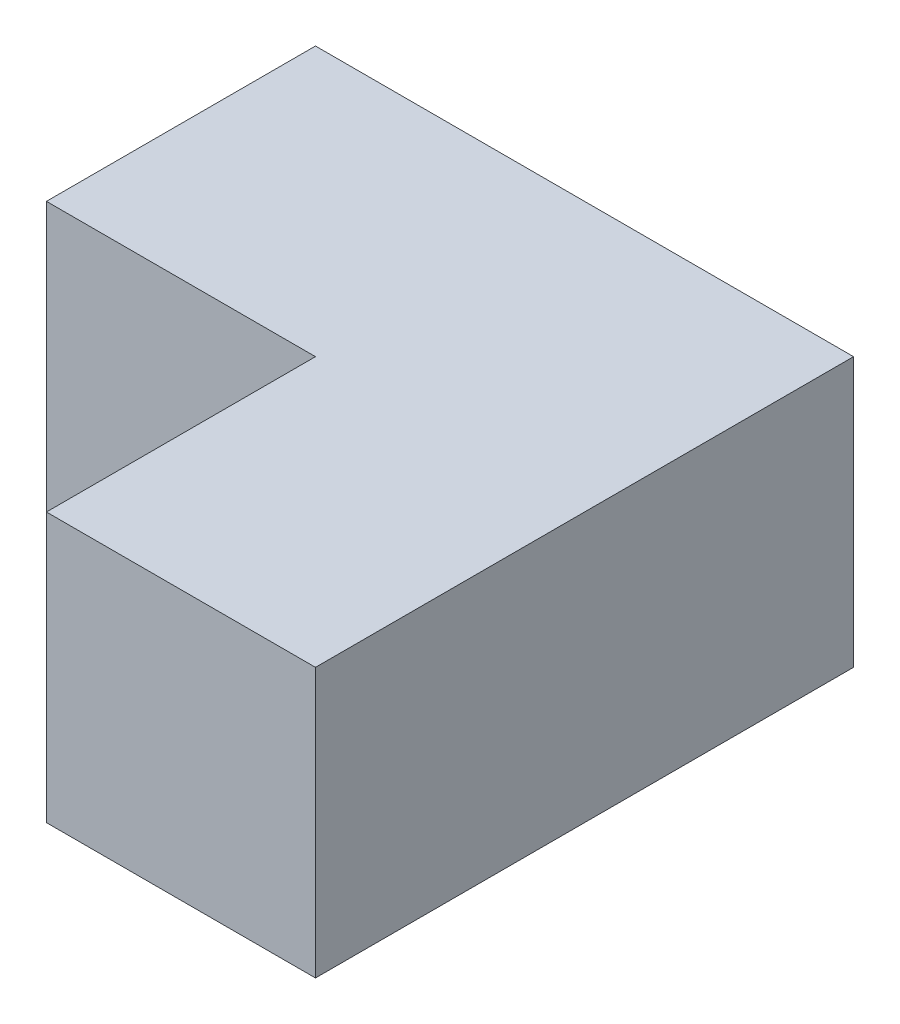
ISO-10303-21;
HEADER;
FILE_DESCRIPTION(('STEP AP214'),'2;1');
FILE_NAME('part.step','',(''),(''),'','','');
FILE_SCHEMA(('AUTOMOTIVE_DESIGN { 1 0 10303 214 1 1 1 1 }'));
ENDSEC;
DATA;
#1=APPLICATION_CONTEXT('core data for automotive mechanical design processes');
#2=APPLICATION_PROTOCOL_DEFINITION('international standard','automotive_design',2000,#1);
#3=PRODUCT_CONTEXT('',#1,'mechanical');
#4=PRODUCT('Part','Part','',(#3));
#5=PRODUCT_RELATED_PRODUCT_CATEGORY('part','',(#4));
#6=PRODUCT_DEFINITION_FORMATION('','',#4);
#7=PRODUCT_DEFINITION_CONTEXT('part definition',#1,'design');
#8=PRODUCT_DEFINITION('design','',#6,#7);
#9=PRODUCT_DEFINITION_SHAPE('','',#8);
#10=(LENGTH_UNIT() NAMED_UNIT(*) SI_UNIT(.MILLI.,.METRE.));
#11=(NAMED_UNIT(*) PLANE_ANGLE_UNIT() SI_UNIT($,.RADIAN.));
#12=(NAMED_UNIT(*) SI_UNIT($,.STERADIAN.) SOLID_ANGLE_UNIT());
#13=UNCERTAINTY_MEASURE_WITH_UNIT(LENGTH_MEASURE(1.E-05),#10,'distance_accuracy_value','');
#14=(GEOMETRIC_REPRESENTATION_CONTEXT(3) GLOBAL_UNCERTAINTY_ASSIGNED_CONTEXT((#13)) GLOBAL_UNIT_ASSIGNED_CONTEXT((#10,
#11,#12)) REPRESENTATION_CONTEXT('',''));
#15=CARTESIAN_POINT('',(0.,0.,0.));
#16=DIRECTION('',(0.,0.,1.));
#17=DIRECTION('',(1.,0.,0.));
#18=AXIS2_PLACEMENT_3D('',#15,#16,#17);
#19=CARTESIAN_POINT('',(25.4,25.4,25.4));
#20=DIRECTION('',(-1.,0.,0.));
#21=DIRECTION('',(0.,0.,1.));
#22=AXIS2_PLACEMENT_3D('',#19,#20,#21);
#23=PLANE('',#22);
#24=DIRECTION('',(0.,0.,-1.));
#25=VECTOR('',#24,1.);
#26=CARTESIAN_POINT('',(25.4,0.,25.4));
#27=LINE('',#26,#25);
#28=CARTESIAN_POINT('',(25.4,0.,25.4));
#29=VERTEX_POINT('',#28);
#30=CARTESIAN_POINT('',(25.4,0.,-25.4));
#31=VERTEX_POINT('',#30);
#32=EDGE_CURVE('E107',#29,#31,#27,.T.);
#33=ORIENTED_EDGE('',*,*,#32,.T.);
#34=DIRECTION('',(0.,-1.,0.));
#35=VECTOR('',#34,1.);
#36=CARTESIAN_POINT('',(25.4,25.4,-25.4));
#37=LINE('',#36,#35);
#38=CARTESIAN_POINT('',(25.4,25.4,-25.4));
#39=VERTEX_POINT('',#38);
#40=EDGE_CURVE('E11',#39,#31,#37,.T.);
#41=ORIENTED_EDGE('',*,*,#40,.F.);
#42=DIRECTION('',(0.,0.,-1.));
#43=VECTOR('',#42,1.);
#44=CARTESIAN_POINT('',(25.4,25.4,25.4));
#45=LINE('',#44,#43);
#46=CARTESIAN_POINT('',(25.4,25.4,25.4));
#47=VERTEX_POINT('',#46);
#48=EDGE_CURVE('E108',#47,#39,#45,.T.);
#49=ORIENTED_EDGE('',*,*,#48,.F.);
#50=DIRECTION('',(0.,-1.,0.));
#51=VECTOR('',#50,1.);
#52=CARTESIAN_POINT('',(25.4,25.4,25.4));
#53=LINE('',#52,#51);
#54=EDGE_CURVE('E117',#47,#29,#53,.T.);
#55=ORIENTED_EDGE('',*,*,#54,.T.);
#56=EDGE_LOOP('',(#33,#41,#49,#55));
#57=FACE_BOUND('',#56,.T.);
#58=ADVANCED_FACE('F33',(#57),#23,.F.);
#59=CARTESIAN_POINT('',(-25.4,25.4,-25.4));
#60=DIRECTION('',(0.,0.,1.));
#61=DIRECTION('',(1.,0.,0.));
#62=AXIS2_PLACEMENT_3D('',#59,#60,#61);
#63=PLANE('',#62);
#64=DIRECTION('',(-1.,0.,0.));
#65=VECTOR('',#64,1.);
#66=CARTESIAN_POINT('',(-25.4,0.,-25.4));
#67=LINE('',#66,#65);
#68=CARTESIAN_POINT('',(-25.4,0.,-25.4));
#69=VERTEX_POINT('',#68);
#70=EDGE_CURVE('E113',#31,#69,#67,.T.);
#71=ORIENTED_EDGE('',*,*,#70,.T.);
#72=DIRECTION('',(0.,-1.,0.));
#73=VECTOR('',#72,1.);
#74=CARTESIAN_POINT('',(-25.4,25.4,-25.4));
#75=LINE('',#74,#73);
#76=CARTESIAN_POINT('',(-25.4,25.4,-25.4));
#77=VERTEX_POINT('',#76);
#78=EDGE_CURVE('E40',#77,#69,#75,.T.);
#79=ORIENTED_EDGE('',*,*,#78,.F.);
#80=DIRECTION('',(-1.,0.,0.));
#81=VECTOR('',#80,1.);
#82=CARTESIAN_POINT('',(-25.4,25.4,-25.4));
#83=LINE('',#82,#81);
#84=EDGE_CURVE('E79',#39,#77,#83,.T.);
#85=ORIENTED_EDGE('',*,*,#84,.F.);
#86=ORIENTED_EDGE('',*,*,#40,.T.);
#87=EDGE_LOOP('',(#71,#79,#85,#86));
#88=FACE_BOUND('',#87,.T.);
#89=ADVANCED_FACE('F137',(#88),#63,.F.);
#90=CARTESIAN_POINT('',(-25.4,25.4,25.4));
#91=DIRECTION('',(1.,0.,0.));
#92=DIRECTION('',(0.,0.,-1.));
#93=AXIS2_PLACEMENT_3D('',#90,#91,#92);
#94=PLANE('',#93);
#95=DIRECTION('',(0.,0.,1.));
#96=VECTOR('',#95,1.);
#97=CARTESIAN_POINT('',(-25.4,0.,25.4));
#98=LINE('',#97,#96);
#99=CARTESIAN_POINT('',(-25.4,0.,0.));
#100=VERTEX_POINT('',#99);
#101=EDGE_CURVE('E109',#69,#100,#98,.T.);
#102=ORIENTED_EDGE('',*,*,#101,.T.);
#103=DIRECTION('',(0.,1.,0.));
#104=VECTOR('',#103,1.);
#105=CARTESIAN_POINT('',(-25.4,0.,0.));
#106=LINE('',#105,#104);
#107=CARTESIAN_POINT('',(-25.4,25.4,0.));
#108=VERTEX_POINT('',#107);
#109=EDGE_CURVE('E131',#100,#108,#106,.T.);
#110=ORIENTED_EDGE('',*,*,#109,.T.);
#111=DIRECTION('',(0.,0.,1.));
#112=VECTOR('',#111,1.);
#113=CARTESIAN_POINT('',(-25.4,25.4,25.4));
#114=LINE('',#113,#112);
#115=EDGE_CURVE('E125',#77,#108,#114,.T.);
#116=ORIENTED_EDGE('',*,*,#115,.F.);
#117=ORIENTED_EDGE('',*,*,#78,.T.);
#118=EDGE_LOOP('',(#102,#110,#116,#117));
#119=FACE_BOUND('',#118,.T.);
#120=ADVANCED_FACE('F122',(#119),#94,.F.);
#121=CARTESIAN_POINT('',(-25.4,25.4,25.4));
#122=DIRECTION('',(0.,0.,-1.));
#123=DIRECTION('',(-1.,0.,0.));
#124=AXIS2_PLACEMENT_3D('',#121,#122,#123);
#125=PLANE('',#124);
#126=DIRECTION('',(1.,0.,0.));
#127=VECTOR('',#126,1.);
#128=CARTESIAN_POINT('',(-25.4,25.4,25.4));
#129=LINE('',#128,#127);
#130=CARTESIAN_POINT('',(0.,25.4,25.4));
#131=VERTEX_POINT('',#130);
#132=EDGE_CURVE('E56',#131,#47,#129,.T.);
#133=ORIENTED_EDGE('',*,*,#132,.F.);
#134=DIRECTION('',(0.,1.,0.));
#135=VECTOR('',#134,1.);
#136=CARTESIAN_POINT('',(0.,0.,25.4));
#137=LINE('',#136,#135);
#138=CARTESIAN_POINT('',(0.,0.,25.4));
#139=VERTEX_POINT('',#138);
#140=EDGE_CURVE('E97',#139,#131,#137,.T.);
#141=ORIENTED_EDGE('',*,*,#140,.F.);
#142=DIRECTION('',(1.,0.,0.));
#143=VECTOR('',#142,1.);
#144=CARTESIAN_POINT('',(-25.4,0.,25.4));
#145=LINE('',#144,#143);
#146=EDGE_CURVE('E74',#139,#29,#145,.T.);
#147=ORIENTED_EDGE('',*,*,#146,.T.);
#148=ORIENTED_EDGE('',*,*,#54,.F.);
#149=EDGE_LOOP('',(#133,#141,#147,#148));
#150=FACE_BOUND('',#149,.T.);
#151=ADVANCED_FACE('F102',(#150),#125,.F.);
#152=CARTESIAN_POINT('',(0.,25.4,0.));
#153=DIRECTION('',(0.,-1.,0.));
#154=DIRECTION('',(0.,0.,-1.));
#155=AXIS2_PLACEMENT_3D('',#152,#153,#154);
#156=PLANE('',#155);
#157=ORIENTED_EDGE('',*,*,#115,.T.);
#158=DIRECTION('',(-1.,0.,0.));
#159=VECTOR('',#158,1.);
#160=CARTESIAN_POINT('',(-25.4,25.4,0.));
#161=LINE('',#160,#159);
#162=CARTESIAN_POINT('',(0.,25.4,0.));
#163=VERTEX_POINT('',#162);
#164=EDGE_CURVE('E100',#163,#108,#161,.T.);
#165=ORIENTED_EDGE('',*,*,#164,.F.);
#166=DIRECTION('',(0.,0.,-1.));
#167=VECTOR('',#166,1.);
#168=CARTESIAN_POINT('',(0.,25.4,25.4));
#169=LINE('',#168,#167);
#170=EDGE_CURVE('E128',#131,#163,#169,.T.);
#171=ORIENTED_EDGE('',*,*,#170,.F.);
#172=ORIENTED_EDGE('',*,*,#132,.T.);
#173=ORIENTED_EDGE('',*,*,#48,.T.);
#174=ORIENTED_EDGE('',*,*,#84,.T.);
#175=EDGE_LOOP('',(#157,#165,#171,#172,#173,#174));
#176=FACE_BOUND('',#175,.T.);
#177=ADVANCED_FACE('F141',(#176),#156,.F.);
#178=CARTESIAN_POINT('',(0.,0.,0.));
#179=DIRECTION('',(0.,-1.,0.));
#180=DIRECTION('',(0.,0.,-1.));
#181=AXIS2_PLACEMENT_3D('',#178,#179,#180);
#182=PLANE('',#181);
#183=DIRECTION('',(-1.,0.,0.));
#184=VECTOR('',#183,1.);
#185=CARTESIAN_POINT('',(-25.4,0.,0.));
#186=LINE('',#185,#184);
#187=CARTESIAN_POINT('',(0.,0.,0.));
#188=VERTEX_POINT('',#187);
#189=EDGE_CURVE('E47',#188,#100,#186,.T.);
#190=ORIENTED_EDGE('',*,*,#189,.T.);
#191=ORIENTED_EDGE('',*,*,#101,.F.);
#192=ORIENTED_EDGE('',*,*,#70,.F.);
#193=ORIENTED_EDGE('',*,*,#32,.F.);
#194=ORIENTED_EDGE('',*,*,#146,.F.);
#195=DIRECTION('',(0.,0.,-1.));
#196=VECTOR('',#195,1.);
#197=CARTESIAN_POINT('',(0.,0.,25.4));
#198=LINE('',#197,#196);
#199=EDGE_CURVE('E94',#139,#188,#198,.T.);
#200=ORIENTED_EDGE('',*,*,#199,.T.);
#201=EDGE_LOOP('',(#190,#191,#192,#193,#194,#200));
#202=FACE_BOUND('',#201,.T.);
#203=ADVANCED_FACE('F105',(#202),#182,.T.);
#204=CARTESIAN_POINT('',(-25.4,0.,0.));
#205=DIRECTION('',(0.,0.,-1.));
#206=DIRECTION('',(-1.,0.,0.));
#207=AXIS2_PLACEMENT_3D('',#204,#205,#206);
#208=PLANE('',#207);
#209=ORIENTED_EDGE('',*,*,#164,.T.);
#210=ORIENTED_EDGE('',*,*,#109,.F.);
#211=ORIENTED_EDGE('',*,*,#189,.F.);
#212=DIRECTION('',(0.,1.,0.));
#213=VECTOR('',#212,1.);
#214=CARTESIAN_POINT('',(0.,0.,0.));
#215=LINE('',#214,#213);
#216=EDGE_CURVE('E98',#188,#163,#215,.T.);
#217=ORIENTED_EDGE('',*,*,#216,.T.);
#218=EDGE_LOOP('',(#209,#210,#211,#217));
#219=FACE_BOUND('',#218,.T.);
#220=ADVANCED_FACE('F143',(#219),#208,.F.);
#221=CARTESIAN_POINT('',(0.,0.,25.4));
#222=DIRECTION('',(1.,0.,0.));
#223=DIRECTION('',(0.,0.,-1.));
#224=AXIS2_PLACEMENT_3D('',#221,#222,#223);
#225=PLANE('',#224);
#226=ORIENTED_EDGE('',*,*,#170,.T.);
#227=ORIENTED_EDGE('',*,*,#216,.F.);
#228=ORIENTED_EDGE('',*,*,#199,.F.);
#229=ORIENTED_EDGE('',*,*,#140,.T.);
#230=EDGE_LOOP('',(#226,#227,#228,#229));
#231=FACE_BOUND('',#230,.T.);
#232=ADVANCED_FACE('F96',(#231),#225,.F.);
#233=CLOSED_SHELL('',(#58,#89,#120,#151,#177,#203,#220,#232));
#234=MANIFOLD_SOLID_BREP('B2',#233);
#235=ADVANCED_BREP_SHAPE_REPRESENTATION('',(#18,#234),#14);
#236=SHAPE_DEFINITION_REPRESENTATION(#9,#235);
ENDSEC;
END-ISO-10303-21;
